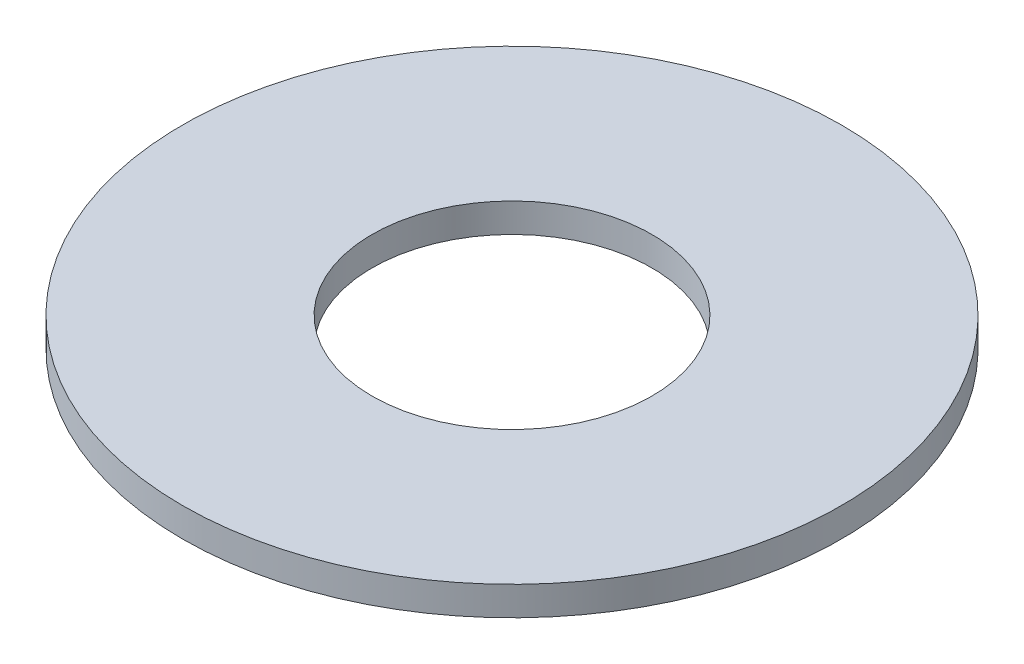
ISO-10303-21;
HEADER;
FILE_DESCRIPTION(('STEP AP214'),'2;1');
FILE_NAME('part.step','',(''),(''),'','','');
FILE_SCHEMA(('AUTOMOTIVE_DESIGN { 1 0 10303 214 1 1 1 1 }'));
ENDSEC;
DATA;
#1=APPLICATION_CONTEXT('core data for automotive mechanical design processes');
#2=APPLICATION_PROTOCOL_DEFINITION('international standard','automotive_design',2000,#1);
#3=PRODUCT_CONTEXT('',#1,'mechanical');
#4=PRODUCT('Part','Part','',(#3));
#5=PRODUCT_RELATED_PRODUCT_CATEGORY('part','',(#4));
#6=PRODUCT_DEFINITION_FORMATION('','',#4);
#7=PRODUCT_DEFINITION_CONTEXT('part definition',#1,'design');
#8=PRODUCT_DEFINITION('design','',#6,#7);
#9=PRODUCT_DEFINITION_SHAPE('','',#8);
#10=(LENGTH_UNIT() NAMED_UNIT(*) SI_UNIT(.MILLI.,.METRE.));
#11=(NAMED_UNIT(*) PLANE_ANGLE_UNIT() SI_UNIT($,.RADIAN.));
#12=(NAMED_UNIT(*) SI_UNIT($,.STERADIAN.) SOLID_ANGLE_UNIT());
#13=UNCERTAINTY_MEASURE_WITH_UNIT(LENGTH_MEASURE(1.E-05),#10,'distance_accuracy_value','');
#14=(GEOMETRIC_REPRESENTATION_CONTEXT(3) GLOBAL_UNCERTAINTY_ASSIGNED_CONTEXT((#13)) GLOBAL_UNIT_ASSIGNED_CONTEXT((#10,
#11,#12)) REPRESENTATION_CONTEXT('',''));
#15=CARTESIAN_POINT('',(0.,0.,0.));
#16=DIRECTION('',(0.,0.,1.));
#17=DIRECTION('',(1.,0.,0.));
#18=AXIS2_PLACEMENT_3D('',#15,#16,#17);
#19=CARTESIAN_POINT('',(0.,1.397,0.));
#20=DIRECTION('',(0.,-1.,0.));
#21=DIRECTION('',(0.,0.,-1.));
#22=AXIS2_PLACEMENT_3D('',#19,#20,#21);
#23=CYLINDRICAL_SURFACE('',#22,15.875);
#24=CARTESIAN_POINT('',(0.,1.397,0.));
#25=DIRECTION('',(0.,1.,0.));
#26=DIRECTION('',(0.,0.,1.));
#27=AXIS2_PLACEMENT_3D('',#24,#25,#26);
#28=CIRCLE('',#27,15.875);
#29=CARTESIAN_POINT('',(0.,1.397,15.875));
#30=VERTEX_POINT('',#29);
#31=EDGE_CURVE('E10',#30,#30,#28,.T.);
#32=ORIENTED_EDGE('',*,*,#31,.F.);
#33=EDGE_LOOP('',(#32));
#34=FACE_BOUND('',#33,.T.);
#35=CARTESIAN_POINT('',(0.,0.,0.));
#36=DIRECTION('',(0.,1.,0.));
#37=DIRECTION('',(0.,0.,1.));
#38=AXIS2_PLACEMENT_3D('',#35,#36,#37);
#39=CIRCLE('',#38,15.875);
#40=CARTESIAN_POINT('',(0.,0.,15.875));
#41=VERTEX_POINT('',#40);
#42=EDGE_CURVE('E35',#41,#41,#39,.T.);
#43=ORIENTED_EDGE('',*,*,#42,.T.);
#44=EDGE_LOOP('',(#43));
#45=FACE_BOUND('',#44,.T.);
#46=ADVANCED_FACE('F32',(#34,#45),#23,.T.);
#47=CARTESIAN_POINT('',(0.,1.397,0.));
#48=DIRECTION('',(0.,1.,0.));
#49=DIRECTION('',(0.,0.,1.));
#50=AXIS2_PLACEMENT_3D('',#47,#48,#49);
#51=PLANE('',#50);
#52=CARTESIAN_POINT('',(0.,1.397,0.));
#53=DIRECTION('',(0.,1.,0.));
#54=DIRECTION('',(0.,0.,1.));
#55=AXIS2_PLACEMENT_3D('',#52,#53,#54);
#56=CIRCLE('',#55,6.7437);
#57=CARTESIAN_POINT('',(0.,1.397,6.7437));
#58=VERTEX_POINT('',#57);
#59=EDGE_CURVE('E44',#58,#58,#56,.T.);
#60=ORIENTED_EDGE('',*,*,#59,.F.);
#61=EDGE_LOOP('',(#60));
#62=FACE_BOUND('',#61,.T.);
#63=ORIENTED_EDGE('',*,*,#31,.T.);
#64=EDGE_LOOP('',(#63));
#65=FACE_BOUND('',#64,.T.);
#66=ADVANCED_FACE('F59',(#62,#65),#51,.T.);
#67=CARTESIAN_POINT('',(0.,0.,0.));
#68=DIRECTION('',(0.,1.,0.));
#69=DIRECTION('',(0.,0.,1.));
#70=AXIS2_PLACEMENT_3D('',#67,#68,#69);
#71=PLANE('',#70);
#72=CARTESIAN_POINT('',(0.,0.,0.));
#73=DIRECTION('',(0.,1.,0.));
#74=DIRECTION('',(0.,0.,1.));
#75=AXIS2_PLACEMENT_3D('',#72,#73,#74);
#76=CIRCLE('',#75,6.7437);
#77=CARTESIAN_POINT('',(0.,0.,6.7437));
#78=VERTEX_POINT('',#77);
#79=EDGE_CURVE('E42',#78,#78,#76,.T.);
#80=ORIENTED_EDGE('',*,*,#79,.T.);
#81=EDGE_LOOP('',(#80));
#82=FACE_BOUND('',#81,.T.);
#83=ORIENTED_EDGE('',*,*,#42,.F.);
#84=EDGE_LOOP('',(#83));
#85=FACE_BOUND('',#84,.T.);
#86=ADVANCED_FACE('F50',(#82,#85),#71,.F.);
#87=CARTESIAN_POINT('',(0.,0.,0.));
#88=DIRECTION('',(0.,1.,0.));
#89=DIRECTION('',(0.,0.,1.));
#90=AXIS2_PLACEMENT_3D('',#87,#88,#89);
#91=CYLINDRICAL_SURFACE('',#90,6.7437);
#92=ORIENTED_EDGE('',*,*,#79,.F.);
#93=EDGE_LOOP('',(#92));
#94=FACE_BOUND('',#93,.T.);
#95=ORIENTED_EDGE('',*,*,#59,.T.);
#96=EDGE_LOOP('',(#95));
#97=FACE_BOUND('',#96,.T.);
#98=ADVANCED_FACE('F53',(#94,#97),#91,.F.);
#99=CLOSED_SHELL('',(#46,#66,#86,#98));
#100=MANIFOLD_SOLID_BREP('B2',#99);
#101=ADVANCED_BREP_SHAPE_REPRESENTATION('',(#18,#100),#14);
#102=SHAPE_DEFINITION_REPRESENTATION(#9,#101);
ENDSEC;
END-ISO-10303-21;
